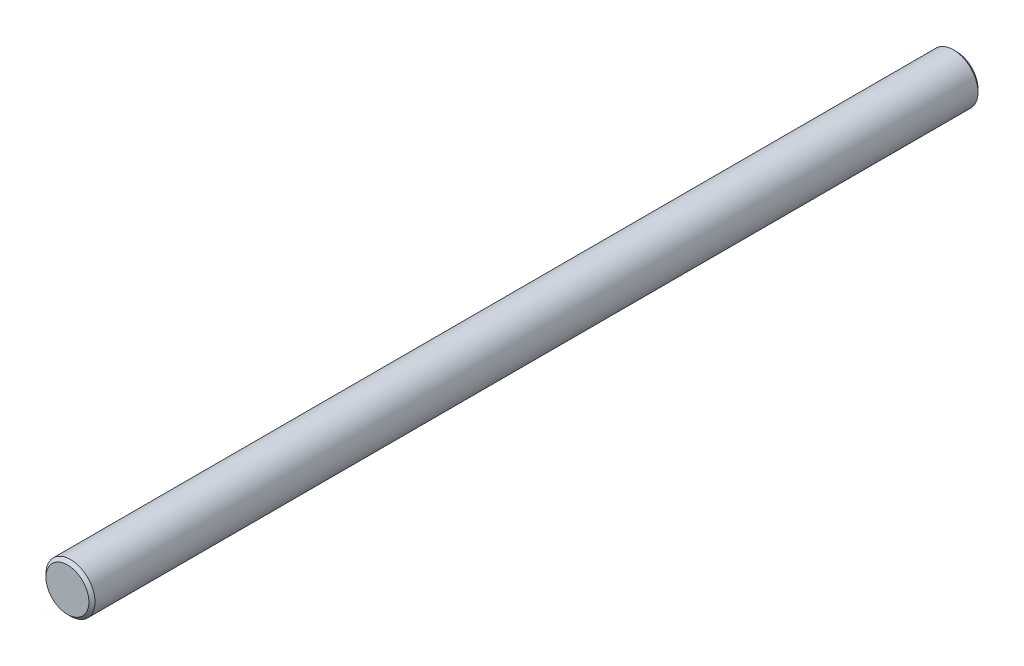
ISO-10303-21;
HEADER;
FILE_DESCRIPTION(('STEP AP214'),'2;1');
FILE_NAME('part.step','',(''),(''),'','','');
FILE_SCHEMA(('AUTOMOTIVE_DESIGN { 1 0 10303 214 1 1 1 1 }'));
ENDSEC;
DATA;
#1=APPLICATION_CONTEXT('core data for automotive mechanical design processes');
#2=APPLICATION_PROTOCOL_DEFINITION('international standard','automotive_design',2000,#1);
#3=PRODUCT_CONTEXT('',#1,'mechanical');
#4=PRODUCT('Part','Part','',(#3));
#5=PRODUCT_RELATED_PRODUCT_CATEGORY('part','',(#4));
#6=PRODUCT_DEFINITION_FORMATION('','',#4);
#7=PRODUCT_DEFINITION_CONTEXT('part definition',#1,'design');
#8=PRODUCT_DEFINITION('design','',#6,#7);
#9=PRODUCT_DEFINITION_SHAPE('','',#8);
#10=(LENGTH_UNIT() NAMED_UNIT(*) SI_UNIT(.MILLI.,.METRE.));
#11=(NAMED_UNIT(*) PLANE_ANGLE_UNIT() SI_UNIT($,.RADIAN.));
#12=(NAMED_UNIT(*) SI_UNIT($,.STERADIAN.) SOLID_ANGLE_UNIT());
#13=UNCERTAINTY_MEASURE_WITH_UNIT(LENGTH_MEASURE(1.E-05),#10,'distance_accuracy_value','');
#14=(GEOMETRIC_REPRESENTATION_CONTEXT(3) GLOBAL_UNCERTAINTY_ASSIGNED_CONTEXT((#13)) GLOBAL_UNIT_ASSIGNED_CONTEXT((#10,
#11,#12)) REPRESENTATION_CONTEXT('',''));
#15=CARTESIAN_POINT('',(0.,0.,0.));
#16=DIRECTION('',(0.,0.,1.));
#17=DIRECTION('',(1.,0.,0.));
#18=AXIS2_PLACEMENT_3D('',#15,#16,#17);
#19=CARTESIAN_POINT('',(0.,0.,145.));
#20=DIRECTION('',(0.,0.,-1.));
#21=DIRECTION('',(-1.,0.,0.));
#22=AXIS2_PLACEMENT_3D('',#19,#20,#21);
#23=CYLINDRICAL_SURFACE('',#22,4.);
#24=CARTESIAN_POINT('',(0.,0.,144.5));
#25=DIRECTION('',(0.,0.,1.));
#26=DIRECTION('',(1.,0.,0.));
#27=AXIS2_PLACEMENT_3D('',#24,#25,#26);
#28=CIRCLE('',#27,4.);
#29=CARTESIAN_POINT('',(4.,0.,144.5));
#30=VERTEX_POINT('',#29);
#31=EDGE_CURVE('E40',#30,#30,#28,.F.);
#32=ORIENTED_EDGE('',*,*,#31,.T.);
#33=EDGE_LOOP('',(#32));
#34=FACE_BOUND('',#33,.T.);
#35=CARTESIAN_POINT('',(0.,0.,0.500000000000028));
#36=DIRECTION('',(0.,0.,1.));
#37=DIRECTION('',(1.,0.,0.));
#38=AXIS2_PLACEMENT_3D('',#35,#36,#37);
#39=CIRCLE('',#38,4.);
#40=CARTESIAN_POINT('',(4.,0.,0.500000000000028));
#41=VERTEX_POINT('',#40);
#42=EDGE_CURVE('E44',#41,#41,#39,.T.);
#43=ORIENTED_EDGE('',*,*,#42,.T.);
#44=EDGE_LOOP('',(#43));
#45=FACE_BOUND('',#44,.T.);
#46=ADVANCED_FACE('F33',(#34,#45),#23,.T.);
#47=CARTESIAN_POINT('',(0.,0.,145.));
#48=DIRECTION('',(0.,0.,1.));
#49=DIRECTION('',(1.,0.,0.));
#50=AXIS2_PLACEMENT_3D('',#47,#48,#49);
#51=PLANE('',#50);
#52=CARTESIAN_POINT('',(0.,0.,145.));
#53=DIRECTION('',(0.,0.,1.));
#54=DIRECTION('',(1.,0.,0.));
#55=AXIS2_PLACEMENT_3D('',#52,#53,#54);
#56=CIRCLE('',#55,3.49999999999998);
#57=CARTESIAN_POINT('',(3.49999999999998,0.,145.));
#58=VERTEX_POINT('',#57);
#59=EDGE_CURVE('E48',#58,#58,#56,.T.);
#60=ORIENTED_EDGE('',*,*,#59,.T.);
#61=EDGE_LOOP('',(#60));
#62=FACE_BOUND('',#61,.T.);
#63=ADVANCED_FACE('F54',(#62),#51,.T.);
#64=CARTESIAN_POINT('',(0.,0.,0.));
#65=DIRECTION('',(0.,0.,1.));
#66=DIRECTION('',(1.,0.,0.));
#67=AXIS2_PLACEMENT_3D('',#64,#65,#66);
#68=PLANE('',#67);
#69=CARTESIAN_POINT('',(0.,0.,0.));
#70=DIRECTION('',(0.,0.,1.));
#71=DIRECTION('',(1.,0.,0.));
#72=AXIS2_PLACEMENT_3D('',#69,#70,#71);
#73=CIRCLE('',#72,3.49999999999998);
#74=CARTESIAN_POINT('',(3.49999999999998,0.,0.));
#75=VERTEX_POINT('',#74);
#76=EDGE_CURVE('E10',#75,#75,#73,.F.);
#77=ORIENTED_EDGE('',*,*,#76,.T.);
#78=EDGE_LOOP('',(#77));
#79=FACE_BOUND('',#78,.T.);
#80=ADVANCED_FACE('F58',(#79),#68,.F.);
#81=CARTESIAN_POINT('',(0.,0.,145.));
#82=DIRECTION('',(0.,0.,-1.));
#83=DIRECTION('',(-1.,0.,0.));
#84=AXIS2_PLACEMENT_3D('',#81,#82,#83);
#85=CONICAL_SURFACE('',#84,3.49999999999998,0.785398163397445);
#86=ORIENTED_EDGE('',*,*,#31,.F.);
#87=EDGE_LOOP('',(#86));
#88=FACE_BOUND('',#87,.T.);
#89=ORIENTED_EDGE('',*,*,#59,.F.);
#90=EDGE_LOOP('',(#89));
#91=FACE_BOUND('',#90,.T.);
#92=ADVANCED_FACE('F56',(#88,#91),#85,.T.);
#93=CARTESIAN_POINT('',(0.,0.,0.500000000000028));
#94=DIRECTION('',(0.,0.,1.));
#95=DIRECTION('',(1.,0.,0.));
#96=AXIS2_PLACEMENT_3D('',#93,#94,#95);
#97=CONICAL_SURFACE('',#96,4.,0.785398163397445);
#98=ORIENTED_EDGE('',*,*,#76,.F.);
#99=EDGE_LOOP('',(#98));
#100=FACE_BOUND('',#99,.T.);
#101=ORIENTED_EDGE('',*,*,#42,.F.);
#102=EDGE_LOOP('',(#101));
#103=FACE_BOUND('',#102,.T.);
#104=ADVANCED_FACE('F35',(#100,#103),#97,.T.);
#105=CLOSED_SHELL('',(#46,#63,#80,#92,#104));
#106=MANIFOLD_SOLID_BREP('B2',#105);
#107=ADVANCED_BREP_SHAPE_REPRESENTATION('',(#18,#106),#14);
#108=SHAPE_DEFINITION_REPRESENTATION(#9,#107);
ENDSEC;
END-ISO-10303-21;
